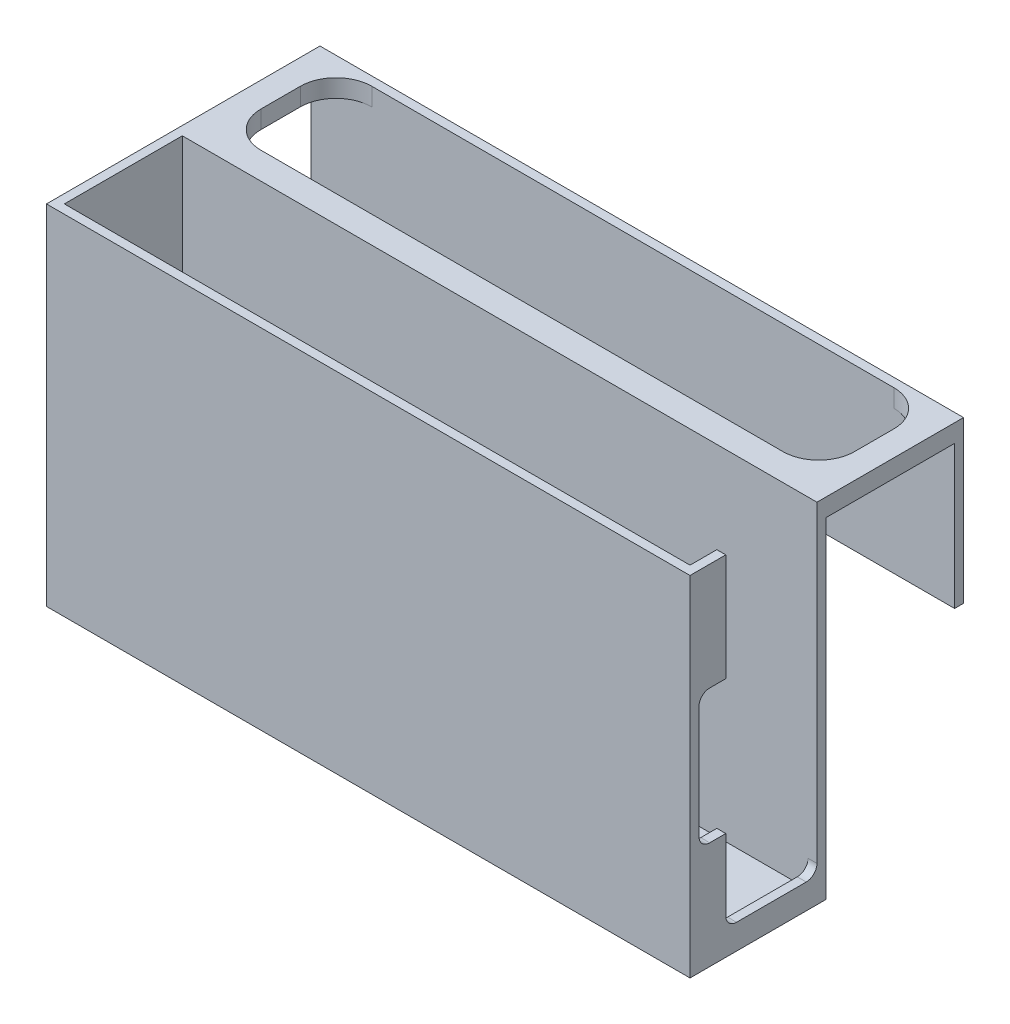
ISO-10303-21;
HEADER;
FILE_DESCRIPTION(('STEP AP214'),'2;1');
FILE_NAME('part.step','',(''),(''),'','','');
FILE_SCHEMA(('AUTOMOTIVE_DESIGN { 1 0 10303 214 1 1 1 1 }'));
ENDSEC;
DATA;
#1=APPLICATION_CONTEXT('core data for automotive mechanical design processes');
#2=APPLICATION_PROTOCOL_DEFINITION('international standard','automotive_design',2000,#1);
#3=PRODUCT_CONTEXT('',#1,'mechanical');
#4=PRODUCT('Part','Part','',(#3));
#5=PRODUCT_RELATED_PRODUCT_CATEGORY('part','',(#4));
#6=PRODUCT_DEFINITION_FORMATION('','',#4);
#7=PRODUCT_DEFINITION_CONTEXT('part definition',#1,'design');
#8=PRODUCT_DEFINITION('design','',#6,#7);
#9=PRODUCT_DEFINITION_SHAPE('','',#8);
#10=(LENGTH_UNIT() NAMED_UNIT(*) SI_UNIT(.MILLI.,.METRE.));
#11=(NAMED_UNIT(*) PLANE_ANGLE_UNIT() SI_UNIT($,.RADIAN.));
#12=(NAMED_UNIT(*) SI_UNIT($,.STERADIAN.) SOLID_ANGLE_UNIT());
#13=UNCERTAINTY_MEASURE_WITH_UNIT(LENGTH_MEASURE(1.E-05),#10,'distance_accuracy_value','');
#14=(GEOMETRIC_REPRESENTATION_CONTEXT(3) GLOBAL_UNCERTAINTY_ASSIGNED_CONTEXT((#13)) GLOBAL_UNIT_ASSIGNED_CONTEXT((#10,
#11,#12)) REPRESENTATION_CONTEXT('',''));
#15=CARTESIAN_POINT('',(0.,0.,0.));
#16=DIRECTION('',(0.,0.,1.));
#17=DIRECTION('',(1.,0.,0.));
#18=AXIS2_PLACEMENT_3D('',#15,#16,#17);
#19=CARTESIAN_POINT('',(-73.,43.75,-61.5));
#20=DIRECTION('',(0.,-1.,0.));
#21=DIRECTION('',(0.,0.,-1.));
#22=AXIS2_PLACEMENT_3D('',#19,#20,#21);
#23=CYLINDRICAL_SURFACE('',#22,10.);
#24=DIRECTION('',(0.,1.,0.));
#25=VECTOR('',#24,1.);
#26=CARTESIAN_POINT('',(-83.,43.75,-61.5));
#27=LINE('',#26,#25);
#28=CARTESIAN_POINT('',(-83.,43.75,-61.5));
#29=VERTEX_POINT('',#28);
#30=CARTESIAN_POINT('',(-83.,48.75,-61.5));
#31=VERTEX_POINT('',#30);
#32=EDGE_CURVE('E380',#29,#31,#27,.T.);
#33=ORIENTED_EDGE('',*,*,#32,.F.);
#34=CARTESIAN_POINT('',(-73.,43.75,-61.5));
#35=DIRECTION('',(0.,1.,0.));
#36=DIRECTION('',(-1.,0.,0.));
#37=AXIS2_PLACEMENT_3D('',#34,#35,#36);
#38=CIRCLE('',#37,10.);
#39=CARTESIAN_POINT('',(-73.,43.75,-71.5));
#40=VERTEX_POINT('',#39);
#41=EDGE_CURVE('E39',#29,#40,#38,.F.);
#42=ORIENTED_EDGE('',*,*,#41,.T.);
#43=DIRECTION('',(0.,1.,0.));
#44=VECTOR('',#43,1.);
#45=CARTESIAN_POINT('',(-73.,43.75,-71.5));
#46=LINE('',#45,#44);
#47=CARTESIAN_POINT('',(-73.,48.75,-71.5));
#48=VERTEX_POINT('',#47);
#49=EDGE_CURVE('E383',#48,#40,#46,.F.);
#50=ORIENTED_EDGE('',*,*,#49,.F.);
#51=CARTESIAN_POINT('',(-73.,48.75,-61.5));
#52=DIRECTION('',(0.,-1.,0.));
#53=DIRECTION('',(0.,0.,-1.));
#54=AXIS2_PLACEMENT_3D('',#51,#52,#53);
#55=CIRCLE('',#54,10.);
#56=EDGE_CURVE('E11',#48,#31,#55,.F.);
#57=ORIENTED_EDGE('',*,*,#56,.T.);
#58=EDGE_LOOP('',(#33,#42,#50,#57));
#59=FACE_BOUND('',#58,.T.);
#60=ADVANCED_FACE('F32',(#59),#23,.F.);
#61=CARTESIAN_POINT('',(-73.,43.75,-50.5));
#62=DIRECTION('',(0.,-1.,0.));
#63=DIRECTION('',(0.,0.,-1.));
#64=AXIS2_PLACEMENT_3D('',#61,#62,#63);
#65=CYLINDRICAL_SURFACE('',#64,10.);
#66=DIRECTION('',(0.,1.,0.));
#67=VECTOR('',#66,1.);
#68=CARTESIAN_POINT('',(-73.,43.75,-40.5));
#69=LINE('',#68,#67);
#70=CARTESIAN_POINT('',(-73.,43.75,-40.5));
#71=VERTEX_POINT('',#70);
#72=CARTESIAN_POINT('',(-73.,48.75,-40.5));
#73=VERTEX_POINT('',#72);
#74=EDGE_CURVE('E369',#71,#73,#69,.T.);
#75=ORIENTED_EDGE('',*,*,#74,.F.);
#76=CARTESIAN_POINT('',(-73.,43.75,-50.5));
#77=DIRECTION('',(0.,1.,0.));
#78=DIRECTION('',(-1.,0.,0.));
#79=AXIS2_PLACEMENT_3D('',#76,#77,#78);
#80=CIRCLE('',#79,10.);
#81=CARTESIAN_POINT('',(-83.,43.75,-50.5));
#82=VERTEX_POINT('',#81);
#83=EDGE_CURVE('E375',#71,#82,#80,.F.);
#84=ORIENTED_EDGE('',*,*,#83,.T.);
#85=DIRECTION('',(0.,1.,0.));
#86=VECTOR('',#85,1.);
#87=CARTESIAN_POINT('',(-83.,43.75,-50.5));
#88=LINE('',#87,#86);
#89=CARTESIAN_POINT('',(-83.,48.75,-50.5));
#90=VERTEX_POINT('',#89);
#91=EDGE_CURVE('E372',#90,#82,#88,.F.);
#92=ORIENTED_EDGE('',*,*,#91,.F.);
#93=CARTESIAN_POINT('',(-73.,48.75,-50.5));
#94=DIRECTION('',(0.,-1.,0.));
#95=DIRECTION('',(0.,0.,-1.));
#96=AXIS2_PLACEMENT_3D('',#93,#94,#95);
#97=CIRCLE('',#96,10.);
#98=EDGE_CURVE('E378',#90,#73,#97,.F.);
#99=ORIENTED_EDGE('',*,*,#98,.T.);
#100=EDGE_LOOP('',(#75,#84,#92,#99));
#101=FACE_BOUND('',#100,.T.);
#102=ADVANCED_FACE('F560',(#101),#65,.F.);
#103=CARTESIAN_POINT('',(73.,43.75,-61.5));
#104=DIRECTION('',(0.,1.,0.));
#105=DIRECTION('',(0.,0.,1.));
#106=AXIS2_PLACEMENT_3D('',#103,#104,#105);
#107=CYLINDRICAL_SURFACE('',#106,10.);
#108=DIRECTION('',(0.,-1.,0.));
#109=VECTOR('',#108,1.);
#110=CARTESIAN_POINT('',(83.,43.75,-61.5));
#111=LINE('',#110,#109);
#112=CARTESIAN_POINT('',(83.,48.75,-61.5));
#113=VERTEX_POINT('',#112);
#114=CARTESIAN_POINT('',(83.,43.75,-61.5));
#115=VERTEX_POINT('',#114);
#116=EDGE_CURVE('E359',#113,#115,#111,.T.);
#117=ORIENTED_EDGE('',*,*,#116,.F.);
#118=CARTESIAN_POINT('',(73.,48.75,-61.5));
#119=DIRECTION('',(0.,-1.,0.));
#120=DIRECTION('',(0.,0.,-1.));
#121=AXIS2_PLACEMENT_3D('',#118,#119,#120);
#122=CIRCLE('',#121,10.);
#123=CARTESIAN_POINT('',(72.9999999999999,48.75,-71.5));
#124=VERTEX_POINT('',#123);
#125=EDGE_CURVE('E365',#113,#124,#122,.F.);
#126=ORIENTED_EDGE('',*,*,#125,.T.);
#127=DIRECTION('',(0.,-1.,0.));
#128=VECTOR('',#127,1.);
#129=CARTESIAN_POINT('',(73.,43.75,-71.5));
#130=LINE('',#129,#128);
#131=CARTESIAN_POINT('',(73.,43.75,-71.5));
#132=VERTEX_POINT('',#131);
#133=EDGE_CURVE('E362',#132,#124,#130,.F.);
#134=ORIENTED_EDGE('',*,*,#133,.F.);
#135=CARTESIAN_POINT('',(73.,43.75,-61.5));
#136=DIRECTION('',(0.,1.,0.));
#137=DIRECTION('',(-1.,0.,0.));
#138=AXIS2_PLACEMENT_3D('',#135,#136,#137);
#139=CIRCLE('',#138,10.);
#140=EDGE_CURVE('E367',#132,#115,#139,.F.);
#141=ORIENTED_EDGE('',*,*,#140,.T.);
#142=EDGE_LOOP('',(#117,#126,#134,#141));
#143=FACE_BOUND('',#142,.T.);
#144=ADVANCED_FACE('F564',(#143),#107,.F.);
#145=CARTESIAN_POINT('',(73.,43.75,-50.5));
#146=DIRECTION('',(0.,-1.,0.));
#147=DIRECTION('',(0.,0.,-1.));
#148=AXIS2_PLACEMENT_3D('',#145,#146,#147);
#149=CYLINDRICAL_SURFACE('',#148,10.);
#150=DIRECTION('',(0.,1.,0.));
#151=VECTOR('',#150,1.);
#152=CARTESIAN_POINT('',(83.,43.75,-50.5));
#153=LINE('',#152,#151);
#154=CARTESIAN_POINT('',(83.,43.75,-50.5));
#155=VERTEX_POINT('',#154);
#156=CARTESIAN_POINT('',(83.,48.75,-50.5));
#157=VERTEX_POINT('',#156);
#158=EDGE_CURVE('E348',#155,#157,#153,.T.);
#159=ORIENTED_EDGE('',*,*,#158,.F.);
#160=CARTESIAN_POINT('',(73.,43.75,-50.5));
#161=DIRECTION('',(0.,1.,0.));
#162=DIRECTION('',(-1.,0.,0.));
#163=AXIS2_PLACEMENT_3D('',#160,#161,#162);
#164=CIRCLE('',#163,10.);
#165=CARTESIAN_POINT('',(72.9999999999999,43.75,-40.5));
#166=VERTEX_POINT('',#165);
#167=EDGE_CURVE('E354',#155,#166,#164,.F.);
#168=ORIENTED_EDGE('',*,*,#167,.T.);
#169=DIRECTION('',(0.,1.,0.));
#170=VECTOR('',#169,1.);
#171=CARTESIAN_POINT('',(73.,43.75,-40.5));
#172=LINE('',#171,#170);
#173=CARTESIAN_POINT('',(72.9999999999999,48.75,-40.5));
#174=VERTEX_POINT('',#173);
#175=EDGE_CURVE('E351',#174,#166,#172,.F.);
#176=ORIENTED_EDGE('',*,*,#175,.F.);
#177=CARTESIAN_POINT('',(73.,48.75,-50.5));
#178=DIRECTION('',(0.,-1.,0.));
#179=DIRECTION('',(0.,0.,-1.));
#180=AXIS2_PLACEMENT_3D('',#177,#178,#179);
#181=CIRCLE('',#180,10.);
#182=EDGE_CURVE('E357',#174,#157,#181,.F.);
#183=ORIENTED_EDGE('',*,*,#182,.T.);
#184=EDGE_LOOP('',(#159,#168,#176,#183));
#185=FACE_BOUND('',#184,.T.);
#186=ADVANCED_FACE('F569',(#185),#149,.F.);
#187=CARTESIAN_POINT('',(87.5,46.25,-33.));
#188=DIRECTION('',(-1.,0.,0.));
#189=DIRECTION('',(0.,-1.,0.));
#190=AXIS2_PLACEMENT_3D('',#187,#188,#189);
#191=PLANE('',#190);
#192=CARTESIAN_POINT('',(87.5,-38.75,-30.));
#193=DIRECTION('',(1.,0.,0.));
#194=DIRECTION('',(0.,-1.,0.));
#195=AXIS2_PLACEMENT_3D('',#192,#193,#194);
#196=CIRCLE('',#195,3.);
#197=CARTESIAN_POINT('',(87.5,-41.75,-30.));
#198=VERTEX_POINT('',#197);
#199=CARTESIAN_POINT('',(87.5,-38.75,-33.));
#200=VERTEX_POINT('',#199);
#201=EDGE_CURVE('E255',#198,#200,#196,.T.);
#202=ORIENTED_EDGE('',*,*,#201,.T.);
#203=DIRECTION('',(0.,-1.,0.));
#204=VECTOR('',#203,1.);
#205=CARTESIAN_POINT('',(87.5,46.25,-33.));
#206=LINE('',#205,#204);
#207=CARTESIAN_POINT('',(87.5,-46.25,-33.));
#208=VERTEX_POINT('',#207);
#209=EDGE_CURVE('E312',#200,#208,#206,.T.);
#210=ORIENTED_EDGE('',*,*,#209,.T.);
#211=DIRECTION('',(0.,0.,1.));
#212=VECTOR('',#211,1.);
#213=CARTESIAN_POINT('',(87.5,-46.25,-33.));
#214=LINE('',#213,#212);
#215=CARTESIAN_POINT('',(87.5,-46.25,0.));
#216=VERTEX_POINT('',#215);
#217=EDGE_CURVE('E327',#208,#216,#214,.T.);
#218=ORIENTED_EDGE('',*,*,#217,.T.);
#219=DIRECTION('',(0.,-1.,0.));
#220=VECTOR('',#219,1.);
#221=CARTESIAN_POINT('',(87.5,46.25,0.));
#222=LINE('',#221,#220);
#223=CARTESIAN_POINT('',(87.5,-15.75,0.));
#224=VERTEX_POINT('',#223);
#225=EDGE_CURVE('E311',#224,#216,#222,.T.);
#226=ORIENTED_EDGE('',*,*,#225,.F.);
#227=CARTESIAN_POINT('',(87.5,-15.75,-3.));
#228=DIRECTION('',(1.,0.,0.));
#229=DIRECTION('',(0.,1.,0.));
#230=AXIS2_PLACEMENT_3D('',#227,#228,#229);
#231=CIRCLE('',#230,3.);
#232=CARTESIAN_POINT('',(87.5,-18.75,-3.00000000000002));
#233=VERTEX_POINT('',#232);
#234=EDGE_CURVE('E407',#224,#233,#231,.T.);
#235=ORIENTED_EDGE('',*,*,#234,.T.);
#236=DIRECTION('',(0.,0.,-1.));
#237=VECTOR('',#236,1.);
#238=CARTESIAN_POINT('',(87.5,-18.75,-3.00000000000003));
#239=LINE('',#238,#237);
#240=CARTESIAN_POINT('',(87.5,-18.75,-7.50000000000001));
#241=VERTEX_POINT('',#240);
#242=EDGE_CURVE('E410',#233,#241,#239,.T.);
#243=ORIENTED_EDGE('',*,*,#242,.T.);
#244=DIRECTION('',(0.,-1.,0.));
#245=VECTOR('',#244,1.);
#246=CARTESIAN_POINT('',(87.5,-18.75,-7.50000000000001));
#247=LINE('',#246,#245);
#248=CARTESIAN_POINT('',(87.5,-38.75,-7.50000000000001));
#249=VERTEX_POINT('',#248);
#250=EDGE_CURVE('E413',#241,#249,#247,.T.);
#251=ORIENTED_EDGE('',*,*,#250,.T.);
#252=CARTESIAN_POINT('',(87.5,-38.75,-10.5));
#253=DIRECTION('',(1.,0.,0.));
#254=DIRECTION('',(0.,-1.,0.));
#255=AXIS2_PLACEMENT_3D('',#252,#253,#254);
#256=CIRCLE('',#255,3.);
#257=CARTESIAN_POINT('',(87.5,-41.75,-10.5));
#258=VERTEX_POINT('',#257);
#259=EDGE_CURVE('E416',#249,#258,#256,.T.);
#260=ORIENTED_EDGE('',*,*,#259,.T.);
#261=DIRECTION('',(0.,0.,-1.));
#262=VECTOR('',#261,1.);
#263=CARTESIAN_POINT('',(87.5,-41.75,-30.));
#264=LINE('',#263,#262);
#265=EDGE_CURVE('E419',#258,#198,#264,.T.);
#266=ORIENTED_EDGE('',*,*,#265,.T.);
#267=EDGE_LOOP('',(#202,#210,#218,#226,#235,#243,#251,#260,#266));
#268=FACE_BOUND('',#267,.T.);
#269=ADVANCED_FACE('F488',(#268),#191,.T.);
#270=CARTESIAN_POINT('',(90.,43.75,-74.));
#271=DIRECTION('',(0.,1.,0.));
#272=DIRECTION('',(-1.,0.,0.));
#273=AXIS2_PLACEMENT_3D('',#270,#271,#272);
#274=PLANE('',#273);
#275=ORIENTED_EDGE('',*,*,#83,.F.);
#276=DIRECTION('',(1.,0.,0.));
#277=VECTOR('',#276,1.);
#278=CARTESIAN_POINT('',(-83.,43.75,-40.5));
#279=LINE('',#278,#277);
#280=EDGE_CURVE('E397',#71,#166,#279,.T.);
#281=ORIENTED_EDGE('',*,*,#280,.T.);
#282=ORIENTED_EDGE('',*,*,#167,.F.);
#283=DIRECTION('',(0.,0.,-1.));
#284=VECTOR('',#283,1.);
#285=CARTESIAN_POINT('',(83.,43.75,-71.5));
#286=LINE('',#285,#284);
#287=EDGE_CURVE('E428',#155,#115,#286,.T.);
#288=ORIENTED_EDGE('',*,*,#287,.T.);
#289=ORIENTED_EDGE('',*,*,#140,.F.);
#290=DIRECTION('',(-1.,0.,0.));
#291=VECTOR('',#290,1.);
#292=CARTESIAN_POINT('',(-90.,43.75,-71.5));
#293=LINE('',#292,#291);
#294=CARTESIAN_POINT('',(90.,43.75,-71.5));
#295=VERTEX_POINT('',#294);
#296=EDGE_CURVE('E275',#295,#132,#293,.T.);
#297=ORIENTED_EDGE('',*,*,#296,.F.);
#298=DIRECTION('',(0.,0.,1.));
#299=VECTOR('',#298,1.);
#300=CARTESIAN_POINT('',(90.,43.75,-74.));
#301=LINE('',#300,#299);
#302=CARTESIAN_POINT('',(90.,43.75,-35.5));
#303=VERTEX_POINT('',#302);
#304=EDGE_CURVE('E301',#295,#303,#301,.T.);
#305=ORIENTED_EDGE('',*,*,#304,.T.);
#306=DIRECTION('',(-1.,0.,0.));
#307=VECTOR('',#306,1.);
#308=CARTESIAN_POINT('',(90.,43.75,-35.5));
#309=LINE('',#308,#307);
#310=CARTESIAN_POINT('',(-90.,43.75,-35.5));
#311=VERTEX_POINT('',#310);
#312=EDGE_CURVE('E288',#303,#311,#309,.T.);
#313=ORIENTED_EDGE('',*,*,#312,.T.);
#314=DIRECTION('',(0.,0.,1.));
#315=VECTOR('',#314,1.);
#316=CARTESIAN_POINT('',(-90.,43.75,-74.));
#317=LINE('',#316,#315);
#318=CARTESIAN_POINT('',(-90.,43.75,-71.5));
#319=VERTEX_POINT('',#318);
#320=EDGE_CURVE('E297',#319,#311,#317,.T.);
#321=ORIENTED_EDGE('',*,*,#320,.F.);
#322=EDGE_CURVE('E46',#40,#319,#293,.T.);
#323=ORIENTED_EDGE('',*,*,#322,.F.);
#324=ORIENTED_EDGE('',*,*,#41,.F.);
#325=DIRECTION('',(0.,0.,1.));
#326=VECTOR('',#325,1.);
#327=CARTESIAN_POINT('',(-83.,43.75,-71.5));
#328=LINE('',#327,#326);
#329=EDGE_CURVE('E394',#29,#82,#328,.T.);
#330=ORIENTED_EDGE('',*,*,#329,.T.);
#331=EDGE_LOOP('',(#275,#281,#282,#288,#289,#297,#305,#313,#321,#323,#324,#330));
#332=FACE_BOUND('',#331,.T.);
#333=ADVANCED_FACE('F580',(#332),#274,.F.);
#334=CARTESIAN_POINT('',(-90.,48.75,2.5));
#335=DIRECTION('',(1.,0.,0.));
#336=DIRECTION('',(0.,1.,0.));
#337=AXIS2_PLACEMENT_3D('',#334,#335,#336);
#338=PLANE('',#337);
#339=DIRECTION('',(0.,0.,-1.));
#340=VECTOR('',#339,1.);
#341=CARTESIAN_POINT('',(-90.,48.75,2.5));
#342=LINE('',#341,#340);
#343=CARTESIAN_POINT('',(-90.,48.75,2.5));
#344=VERTEX_POINT('',#343);
#345=CARTESIAN_POINT('',(-90.,48.75,-74.));
#346=VERTEX_POINT('',#345);
#347=EDGE_CURVE('E339',#344,#346,#342,.T.);
#348=ORIENTED_EDGE('',*,*,#347,.T.);
#349=DIRECTION('',(0.,1.,0.));
#350=VECTOR('',#349,1.);
#351=CARTESIAN_POINT('',(-90.,48.75,-74.));
#352=LINE('',#351,#350);
#353=CARTESIAN_POINT('',(-90.,3.75000000000001,-74.));
#354=VERTEX_POINT('',#353);
#355=EDGE_CURVE('E291',#354,#346,#352,.T.);
#356=ORIENTED_EDGE('',*,*,#355,.F.);
#357=DIRECTION('',(0.,0.,-1.));
#358=VECTOR('',#357,1.);
#359=CARTESIAN_POINT('',(-90.,3.75000000000001,-74.));
#360=LINE('',#359,#358);
#361=CARTESIAN_POINT('',(-90.,3.75000000000001,-71.5));
#362=VERTEX_POINT('',#361);
#363=EDGE_CURVE('E271',#362,#354,#360,.T.);
#364=ORIENTED_EDGE('',*,*,#363,.F.);
#365=DIRECTION('',(0.,1.,0.));
#366=VECTOR('',#365,1.);
#367=CARTESIAN_POINT('',(-90.,3.75000000000001,-71.5));
#368=LINE('',#367,#366);
#369=EDGE_CURVE('E282',#362,#319,#368,.T.);
#370=ORIENTED_EDGE('',*,*,#369,.T.);
#371=ORIENTED_EDGE('',*,*,#320,.T.);
#372=DIRECTION('',(0.,1.,0.));
#373=VECTOR('',#372,1.);
#374=CARTESIAN_POINT('',(-90.,48.75,-35.5));
#375=LINE('',#374,#373);
#376=CARTESIAN_POINT('',(-90.,-48.75,-35.5));
#377=VERTEX_POINT('',#376);
#378=EDGE_CURVE('E308',#377,#311,#375,.T.);
#379=ORIENTED_EDGE('',*,*,#378,.F.);
#380=DIRECTION('',(0.,0.,-1.));
#381=VECTOR('',#380,1.);
#382=CARTESIAN_POINT('',(-90.,-48.75,2.5));
#383=LINE('',#382,#381);
#384=CARTESIAN_POINT('',(-90.,-48.75,2.5));
#385=VERTEX_POINT('',#384);
#386=EDGE_CURVE('E346',#385,#377,#383,.T.);
#387=ORIENTED_EDGE('',*,*,#386,.F.);
#388=DIRECTION('',(0.,-1.,0.));
#389=VECTOR('',#388,1.);
#390=CARTESIAN_POINT('',(-90.,48.75,2.5));
#391=LINE('',#390,#389);
#392=EDGE_CURVE('E330',#344,#385,#391,.T.);
#393=ORIENTED_EDGE('',*,*,#392,.F.);
#394=EDGE_LOOP('',(#348,#356,#364,#370,#371,#379,#387,#393));
#395=FACE_BOUND('',#394,.T.);
#396=ADVANCED_FACE('F512',(#395),#338,.F.);
#397=CARTESIAN_POINT('',(-90.,-48.75,2.5));
#398=DIRECTION('',(0.,1.,0.));
#399=DIRECTION('',(0.,0.,1.));
#400=AXIS2_PLACEMENT_3D('',#397,#398,#399);
#401=PLANE('',#400);
#402=ORIENTED_EDGE('',*,*,#386,.T.);
#403=DIRECTION('',(-1.,0.,0.));
#404=VECTOR('',#403,1.);
#405=CARTESIAN_POINT('',(90.,-48.75,-35.5));
#406=LINE('',#405,#404);
#407=CARTESIAN_POINT('',(90.,-48.75,-35.5));
#408=VERTEX_POINT('',#407);
#409=EDGE_CURVE('E305',#408,#377,#406,.T.);
#410=ORIENTED_EDGE('',*,*,#409,.F.);
#411=DIRECTION('',(0.,0.,-1.));
#412=VECTOR('',#411,1.);
#413=CARTESIAN_POINT('',(90.,-48.75,2.5));
#414=LINE('',#413,#412);
#415=CARTESIAN_POINT('',(90.,-48.75,2.5));
#416=VERTEX_POINT('',#415);
#417=EDGE_CURVE('E343',#416,#408,#414,.T.);
#418=ORIENTED_EDGE('',*,*,#417,.F.);
#419=DIRECTION('',(1.,0.,0.));
#420=VECTOR('',#419,1.);
#421=CARTESIAN_POINT('',(-90.,-48.75,2.5));
#422=LINE('',#421,#420);
#423=EDGE_CURVE('E333',#385,#416,#422,.T.);
#424=ORIENTED_EDGE('',*,*,#423,.F.);
#425=EDGE_LOOP('',(#402,#410,#418,#424));
#426=FACE_BOUND('',#425,.T.);
#427=ADVANCED_FACE('F579',(#426),#401,.F.);
#428=CARTESIAN_POINT('',(90.,48.75,2.5));
#429=DIRECTION('',(-1.,0.,0.));
#430=DIRECTION('',(0.,-1.,0.));
#431=AXIS2_PLACEMENT_3D('',#428,#429,#430);
#432=PLANE('',#431);
#433=DIRECTION('',(0.,0.,-1.));
#434=VECTOR('',#433,1.);
#435=CARTESIAN_POINT('',(90.,48.75,2.5));
#436=LINE('',#435,#434);
#437=CARTESIAN_POINT('',(90.,48.75,-33.));
#438=VERTEX_POINT('',#437);
#439=CARTESIAN_POINT('',(90.,48.75,-74.));
#440=VERTEX_POINT('',#439);
#441=EDGE_CURVE('E341',#438,#440,#436,.T.);
#442=ORIENTED_EDGE('',*,*,#441,.F.);
#443=DIRECTION('',(0.,1.,0.));
#444=VECTOR('',#443,1.);
#445=CARTESIAN_POINT('',(90.,48.75,-33.));
#446=LINE('',#445,#444);
#447=CARTESIAN_POINT('',(90.,-38.75,-33.));
#448=VERTEX_POINT('',#447);
#449=EDGE_CURVE('E424',#448,#438,#446,.T.);
#450=ORIENTED_EDGE('',*,*,#449,.F.);
#451=CARTESIAN_POINT('',(90.,-38.75,-30.));
#452=DIRECTION('',(1.,0.,0.));
#453=DIRECTION('',(0.,-1.,0.));
#454=AXIS2_PLACEMENT_3D('',#451,#452,#453);
#455=CIRCLE('',#454,3.);
#456=CARTESIAN_POINT('',(90.,-41.75,-30.));
#457=VERTEX_POINT('',#456);
#458=EDGE_CURVE('E244',#457,#448,#455,.T.);
#459=ORIENTED_EDGE('',*,*,#458,.F.);
#460=DIRECTION('',(0.,0.,-1.));
#461=VECTOR('',#460,1.);
#462=CARTESIAN_POINT('',(90.,-41.75,-30.));
#463=LINE('',#462,#461);
#464=CARTESIAN_POINT('',(90.,-41.75,-10.5));
#465=VERTEX_POINT('',#464);
#466=EDGE_CURVE('E451',#465,#457,#463,.T.);
#467=ORIENTED_EDGE('',*,*,#466,.F.);
#468=CARTESIAN_POINT('',(90.,-38.75,-10.5));
#469=DIRECTION('',(1.,0.,0.));
#470=DIRECTION('',(0.,-1.,0.));
#471=AXIS2_PLACEMENT_3D('',#468,#469,#470);
#472=CIRCLE('',#471,3.);
#473=CARTESIAN_POINT('',(90.,-38.75,-7.50000000000001));
#474=VERTEX_POINT('',#473);
#475=EDGE_CURVE('E448',#474,#465,#472,.T.);
#476=ORIENTED_EDGE('',*,*,#475,.F.);
#477=DIRECTION('',(0.,-1.,0.));
#478=VECTOR('',#477,1.);
#479=CARTESIAN_POINT('',(90.,-18.75,-7.50000000000001));
#480=LINE('',#479,#478);
#481=CARTESIAN_POINT('',(90.,-18.75,-7.50000000000001));
#482=VERTEX_POINT('',#481);
#483=EDGE_CURVE('E445',#482,#474,#480,.T.);
#484=ORIENTED_EDGE('',*,*,#483,.F.);
#485=DIRECTION('',(0.,0.,-1.));
#486=VECTOR('',#485,1.);
#487=CARTESIAN_POINT('',(90.,-18.75,-3.00000000000003));
#488=LINE('',#487,#486);
#489=CARTESIAN_POINT('',(90.,-18.75,-3.00000000000002));
#490=VERTEX_POINT('',#489);
#491=EDGE_CURVE('E442',#490,#482,#488,.T.);
#492=ORIENTED_EDGE('',*,*,#491,.F.);
#493=CARTESIAN_POINT('',(90.,-15.75,-3.));
#494=DIRECTION('',(1.,0.,0.));
#495=DIRECTION('',(0.,1.,0.));
#496=AXIS2_PLACEMENT_3D('',#493,#494,#495);
#497=CIRCLE('',#496,3.);
#498=CARTESIAN_POINT('',(90.,-15.75,0.));
#499=VERTEX_POINT('',#498);
#500=EDGE_CURVE('E439',#499,#490,#497,.T.);
#501=ORIENTED_EDGE('',*,*,#500,.F.);
#502=DIRECTION('',(0.,-1.,0.));
#503=VECTOR('',#502,1.);
#504=CARTESIAN_POINT('',(90.,15.75,0.));
#505=LINE('',#504,#503);
#506=CARTESIAN_POINT('',(90.,15.75,0.));
#507=VERTEX_POINT('',#506);
#508=EDGE_CURVE('E436',#507,#499,#505,.T.);
#509=ORIENTED_EDGE('',*,*,#508,.F.);
#510=CARTESIAN_POINT('',(90.,15.75,-3.));
#511=DIRECTION('',(1.,0.,0.));
#512=DIRECTION('',(0.,1.,0.));
#513=AXIS2_PLACEMENT_3D('',#510,#511,#512);
#514=CIRCLE('',#513,3.);
#515=CARTESIAN_POINT('',(90.,18.75,-3.00000000000002));
#516=VERTEX_POINT('',#515);
#517=EDGE_CURVE('E433',#516,#507,#514,.T.);
#518=ORIENTED_EDGE('',*,*,#517,.F.);
#519=DIRECTION('',(0.,0.,1.));
#520=VECTOR('',#519,1.);
#521=CARTESIAN_POINT('',(90.,18.75,-3.00000000000002));
#522=LINE('',#521,#520);
#523=CARTESIAN_POINT('',(90.,18.75,-7.5));
#524=VERTEX_POINT('',#523);
#525=EDGE_CURVE('E430',#524,#516,#522,.T.);
#526=ORIENTED_EDGE('',*,*,#525,.F.);
#527=DIRECTION('',(0.,-1.,0.));
#528=VECTOR('',#527,1.);
#529=CARTESIAN_POINT('',(90.,48.75,-7.5));
#530=LINE('',#529,#528);
#531=CARTESIAN_POINT('',(90.,48.75,-7.5));
#532=VERTEX_POINT('',#531);
#533=EDGE_CURVE('E427',#532,#524,#530,.T.);
#534=ORIENTED_EDGE('',*,*,#533,.F.);
#535=CARTESIAN_POINT('',(90.,48.75,2.5));
#536=VERTEX_POINT('',#535);
#537=EDGE_CURVE('E254',#536,#532,#436,.T.);
#538=ORIENTED_EDGE('',*,*,#537,.F.);
#539=DIRECTION('',(0.,1.,0.));
#540=VECTOR('',#539,1.);
#541=CARTESIAN_POINT('',(90.,48.75,2.5));
#542=LINE('',#541,#540);
#543=EDGE_CURVE('E335',#416,#536,#542,.T.);
#544=ORIENTED_EDGE('',*,*,#543,.F.);
#545=ORIENTED_EDGE('',*,*,#417,.T.);
#546=DIRECTION('',(0.,-1.,0.));
#547=VECTOR('',#546,1.);
#548=CARTESIAN_POINT('',(90.,48.75,-35.5));
#549=LINE('',#548,#547);
#550=EDGE_CURVE('E303',#303,#408,#549,.T.);
#551=ORIENTED_EDGE('',*,*,#550,.F.);
#552=ORIENTED_EDGE('',*,*,#304,.F.);
#553=DIRECTION('',(0.,1.,0.));
#554=VECTOR('',#553,1.);
#555=CARTESIAN_POINT('',(90.,3.75000000000001,-71.5));
#556=LINE('',#555,#554);
#557=CARTESIAN_POINT('',(90.,3.75000000000001,-71.5));
#558=VERTEX_POINT('',#557);
#559=EDGE_CURVE('E286',#558,#295,#556,.T.);
#560=ORIENTED_EDGE('',*,*,#559,.F.);
#561=DIRECTION('',(0.,0.,1.));
#562=VECTOR('',#561,1.);
#563=CARTESIAN_POINT('',(90.,3.75000000000001,-74.));
#564=LINE('',#563,#562);
#565=CARTESIAN_POINT('',(90.,3.75000000000001,-74.));
#566=VERTEX_POINT('',#565);
#567=EDGE_CURVE('E278',#566,#558,#564,.T.);
#568=ORIENTED_EDGE('',*,*,#567,.F.);
#569=DIRECTION('',(0.,-1.,0.));
#570=VECTOR('',#569,1.);
#571=CARTESIAN_POINT('',(90.,48.75,-74.));
#572=LINE('',#571,#570);
#573=EDGE_CURVE('E289',#440,#566,#572,.T.);
#574=ORIENTED_EDGE('',*,*,#573,.F.);
#575=EDGE_LOOP('',(#442,#450,#459,#467,#476,#484,#492,#501,#509,#518,#526,#534,#538,#544,#545,
#551,#552,#560,#568,#574));
#576=FACE_BOUND('',#575,.T.);
#577=ADVANCED_FACE('F504',(#576),#432,.F.);
#578=CARTESIAN_POINT('',(-90.,48.75,2.5));
#579=DIRECTION('',(0.,-1.,0.));
#580=DIRECTION('',(0.,0.,-1.));
#581=AXIS2_PLACEMENT_3D('',#578,#579,#580);
#582=PLANE('',#581);
#583=DIRECTION('',(1.,0.,0.));
#584=VECTOR('',#583,1.);
#585=CARTESIAN_POINT('',(-83.,48.75,-40.5));
#586=LINE('',#585,#584);
#587=EDGE_CURVE('E400',#73,#174,#586,.T.);
#588=ORIENTED_EDGE('',*,*,#587,.F.);
#589=ORIENTED_EDGE('',*,*,#98,.F.);
#590=DIRECTION('',(0.,0.,1.));
#591=VECTOR('',#590,1.);
#592=CARTESIAN_POINT('',(-83.,48.75,-71.5));
#593=LINE('',#592,#591);
#594=EDGE_CURVE('E894',#31,#90,#593,.T.);
#595=ORIENTED_EDGE('',*,*,#594,.F.);
#596=ORIENTED_EDGE('',*,*,#56,.F.);
#597=DIRECTION('',(-1.,0.,0.));
#598=VECTOR('',#597,1.);
#599=CARTESIAN_POINT('',(-83.,48.75,-71.5));
#600=LINE('',#599,#598);
#601=EDGE_CURVE('E392',#124,#48,#600,.T.);
#602=ORIENTED_EDGE('',*,*,#601,.F.);
#603=ORIENTED_EDGE('',*,*,#125,.F.);
#604=DIRECTION('',(0.,0.,-1.));
#605=VECTOR('',#604,1.);
#606=CARTESIAN_POINT('',(83.,48.75,-71.5));
#607=LINE('',#606,#605);
#608=EDGE_CURVE('E395',#157,#113,#607,.T.);
#609=ORIENTED_EDGE('',*,*,#608,.F.);
#610=ORIENTED_EDGE('',*,*,#182,.F.);
#611=EDGE_LOOP('',(#588,#589,#595,#596,#602,#603,#609,#610));
#612=FACE_BOUND('',#611,.T.);
#613=DIRECTION('',(-1.,0.,0.));
#614=VECTOR('',#613,1.);
#615=CARTESIAN_POINT('',(-87.5,48.75,-33.));
#616=LINE('',#615,#614);
#617=CARTESIAN_POINT('',(-87.5,48.75,-33.));
#618=VERTEX_POINT('',#617);
#619=EDGE_CURVE('E262',#438,#618,#616,.T.);
#620=ORIENTED_EDGE('',*,*,#619,.F.);
#621=ORIENTED_EDGE('',*,*,#441,.T.);
#622=DIRECTION('',(1.,0.,0.));
#623=VECTOR('',#622,1.);
#624=CARTESIAN_POINT('',(90.,48.75,-74.));
#625=LINE('',#624,#623);
#626=EDGE_CURVE('E294',#346,#440,#625,.T.);
#627=ORIENTED_EDGE('',*,*,#626,.F.);
#628=ORIENTED_EDGE('',*,*,#347,.F.);
#629=DIRECTION('',(-1.,0.,0.));
#630=VECTOR('',#629,1.);
#631=CARTESIAN_POINT('',(-90.,48.75,2.5));
#632=LINE('',#631,#630);
#633=EDGE_CURVE('E337',#536,#344,#632,.T.);
#634=ORIENTED_EDGE('',*,*,#633,.F.);
#635=ORIENTED_EDGE('',*,*,#537,.T.);
#636=DIRECTION('',(1.,0.,0.));
#637=VECTOR('',#636,1.);
#638=CARTESIAN_POINT('',(87.5,48.75,-7.5));
#639=LINE('',#638,#637);
#640=CARTESIAN_POINT('',(87.5,48.75,-7.5));
#641=VERTEX_POINT('',#640);
#642=EDGE_CURVE('E236',#641,#532,#639,.T.);
#643=ORIENTED_EDGE('',*,*,#642,.F.);
#644=DIRECTION('',(0.,0.,-1.));
#645=VECTOR('',#644,1.);
#646=CARTESIAN_POINT('',(87.5,48.75,0.));
#647=LINE('',#646,#645);
#648=CARTESIAN_POINT('',(87.5,48.75,0.));
#649=VERTEX_POINT('',#648);
#650=EDGE_CURVE('E251',#649,#641,#647,.T.);
#651=ORIENTED_EDGE('',*,*,#650,.F.);
#652=DIRECTION('',(1.,0.,0.));
#653=VECTOR('',#652,1.);
#654=CARTESIAN_POINT('',(-87.5,48.75,0.));
#655=LINE('',#654,#653);
#656=CARTESIAN_POINT('',(-87.5,48.75,0.));
#657=VERTEX_POINT('',#656);
#658=EDGE_CURVE('E263',#657,#649,#655,.T.);
#659=ORIENTED_EDGE('',*,*,#658,.F.);
#660=DIRECTION('',(0.,0.,1.));
#661=VECTOR('',#660,1.);
#662=CARTESIAN_POINT('',(-87.5,48.75,0.));
#663=LINE('',#662,#661);
#664=EDGE_CURVE('E267',#618,#657,#663,.T.);
#665=ORIENTED_EDGE('',*,*,#664,.F.);
#666=EDGE_LOOP('',(#620,#621,#627,#628,#634,#635,#643,#651,#659,#665));
#667=FACE_BOUND('',#666,.T.);
#668=ADVANCED_FACE('F249',(#612,#667),#582,.F.);
#669=CARTESIAN_POINT('',(0.,0.,2.5));
#670=DIRECTION('',(0.,0.,1.));
#671=DIRECTION('',(1.,0.,0.));
#672=AXIS2_PLACEMENT_3D('',#669,#670,#671);
#673=PLANE('',#672);
#674=ORIENTED_EDGE('',*,*,#392,.T.);
#675=ORIENTED_EDGE('',*,*,#423,.T.);
#676=ORIENTED_EDGE('',*,*,#543,.T.);
#677=ORIENTED_EDGE('',*,*,#633,.T.);
#678=EDGE_LOOP('',(#674,#675,#676,#677));
#679=FACE_BOUND('',#678,.T.);
#680=ADVANCED_FACE('F516',(#679),#673,.T.);
#681=CARTESIAN_POINT('',(0.,0.,-35.5));
#682=DIRECTION('',(0.,0.,-1.));
#683=DIRECTION('',(-1.,0.,0.));
#684=AXIS2_PLACEMENT_3D('',#681,#682,#683);
#685=PLANE('',#684);
#686=ORIENTED_EDGE('',*,*,#312,.F.);
#687=ORIENTED_EDGE('',*,*,#550,.T.);
#688=ORIENTED_EDGE('',*,*,#409,.T.);
#689=ORIENTED_EDGE('',*,*,#378,.T.);
#690=EDGE_LOOP('',(#686,#687,#688,#689));
#691=FACE_BOUND('',#690,.T.);
#692=ADVANCED_FACE('F592',(#691),#685,.T.);
#693=CARTESIAN_POINT('',(0.,0.,-74.));
#694=DIRECTION('',(0.,0.,-1.));
#695=DIRECTION('',(-1.,0.,0.));
#696=AXIS2_PLACEMENT_3D('',#693,#694,#695);
#697=PLANE('',#696);
#698=ORIENTED_EDGE('',*,*,#573,.T.);
#699=DIRECTION('',(1.,0.,0.));
#700=VECTOR('',#699,1.);
#701=CARTESIAN_POINT('',(-90.,3.75000000000001,-74.));
#702=LINE('',#701,#700);
#703=EDGE_CURVE('E274',#354,#566,#702,.T.);
#704=ORIENTED_EDGE('',*,*,#703,.F.);
#705=ORIENTED_EDGE('',*,*,#355,.T.);
#706=ORIENTED_EDGE('',*,*,#626,.T.);
#707=EDGE_LOOP('',(#698,#704,#705,#706));
#708=FACE_BOUND('',#707,.T.);
#709=ADVANCED_FACE('F501',(#708),#697,.T.);
#710=CARTESIAN_POINT('',(-90.,3.75000000000001,-71.5));
#711=DIRECTION('',(0.,0.,-1.));
#712=DIRECTION('',(-1.,0.,0.));
#713=AXIS2_PLACEMENT_3D('',#710,#711,#712);
#714=PLANE('',#713);
#715=ORIENTED_EDGE('',*,*,#601,.T.);
#716=ORIENTED_EDGE('',*,*,#49,.T.);
#717=ORIENTED_EDGE('',*,*,#322,.T.);
#718=ORIENTED_EDGE('',*,*,#369,.F.);
#719=DIRECTION('',(-1.,0.,0.));
#720=VECTOR('',#719,1.);
#721=CARTESIAN_POINT('',(-90.,3.75000000000001,-71.5));
#722=LINE('',#721,#720);
#723=EDGE_CURVE('E280',#558,#362,#722,.T.);
#724=ORIENTED_EDGE('',*,*,#723,.F.);
#725=ORIENTED_EDGE('',*,*,#559,.T.);
#726=ORIENTED_EDGE('',*,*,#296,.T.);
#727=ORIENTED_EDGE('',*,*,#133,.T.);
#728=EDGE_LOOP('',(#715,#716,#717,#718,#724,#725,#726,#727));
#729=FACE_BOUND('',#728,.T.);
#730=ADVANCED_FACE('F390',(#729),#714,.F.);
#731=CARTESIAN_POINT('',(0.,3.75000000000001,0.));
#732=DIRECTION('',(0.,1.,0.));
#733=DIRECTION('',(0.,0.,1.));
#734=AXIS2_PLACEMENT_3D('',#731,#732,#733);
#735=PLANE('',#734);
#736=ORIENTED_EDGE('',*,*,#363,.T.);
#737=ORIENTED_EDGE('',*,*,#703,.T.);
#738=ORIENTED_EDGE('',*,*,#567,.T.);
#739=ORIENTED_EDGE('',*,*,#723,.T.);
#740=EDGE_LOOP('',(#736,#737,#738,#739));
#741=FACE_BOUND('',#740,.T.);
#742=ADVANCED_FACE('F509',(#741),#735,.F.);
#743=CARTESIAN_POINT('',(0.,0.,0.));
#744=DIRECTION('',(0.,0.,1.));
#745=DIRECTION('',(1.,0.,0.));
#746=AXIS2_PLACEMENT_3D('',#743,#744,#745);
#747=PLANE('',#746);
#748=DIRECTION('',(0.,1.,0.));
#749=VECTOR('',#748,1.);
#750=CARTESIAN_POINT('',(-87.5,46.25,0.));
#751=LINE('',#750,#749);
#752=CARTESIAN_POINT('',(-87.5,-46.25,0.));
#753=VERTEX_POINT('',#752);
#754=EDGE_CURVE('E315',#753,#657,#751,.T.);
#755=ORIENTED_EDGE('',*,*,#754,.T.);
#756=ORIENTED_EDGE('',*,*,#658,.T.);
#757=CARTESIAN_POINT('',(87.5,15.75,0.));
#758=VERTEX_POINT('',#757);
#759=EDGE_CURVE('E260',#649,#758,#222,.T.);
#760=ORIENTED_EDGE('',*,*,#759,.T.);
#761=DIRECTION('',(1.,0.,0.));
#762=VECTOR('',#761,1.);
#763=CARTESIAN_POINT('',(87.5,15.75,0.));
#764=LINE('',#763,#762);
#765=EDGE_CURVE('E470',#758,#507,#764,.T.);
#766=ORIENTED_EDGE('',*,*,#765,.T.);
#767=ORIENTED_EDGE('',*,*,#508,.T.);
#768=DIRECTION('',(1.,0.,0.));
#769=VECTOR('',#768,1.);
#770=CARTESIAN_POINT('',(87.5,-15.75,0.));
#771=LINE('',#770,#769);
#772=EDGE_CURVE('E468',#224,#499,#771,.T.);
#773=ORIENTED_EDGE('',*,*,#772,.F.);
#774=ORIENTED_EDGE('',*,*,#225,.T.);
#775=DIRECTION('',(-1.,0.,0.));
#776=VECTOR('',#775,1.);
#777=CARTESIAN_POINT('',(87.5,-46.25,0.));
#778=LINE('',#777,#776);
#779=EDGE_CURVE('E322',#216,#753,#778,.T.);
#780=ORIENTED_EDGE('',*,*,#779,.T.);
#781=EDGE_LOOP('',(#755,#756,#760,#766,#767,#773,#774,#780));
#782=FACE_BOUND('',#781,.T.);
#783=ADVANCED_FACE('F481',(#782),#747,.F.);
#784=CARTESIAN_POINT('',(-87.5,46.25,-33.));
#785=DIRECTION('',(1.,0.,0.));
#786=DIRECTION('',(0.,1.,0.));
#787=AXIS2_PLACEMENT_3D('',#784,#785,#786);
#788=PLANE('',#787);
#789=ORIENTED_EDGE('',*,*,#754,.F.);
#790=DIRECTION('',(0.,0.,1.));
#791=VECTOR('',#790,1.);
#792=CARTESIAN_POINT('',(-87.5,-46.25,-33.));
#793=LINE('',#792,#791);
#794=CARTESIAN_POINT('',(-87.5,-46.25,-33.));
#795=VERTEX_POINT('',#794);
#796=EDGE_CURVE('E320',#795,#753,#793,.T.);
#797=ORIENTED_EDGE('',*,*,#796,.F.);
#798=DIRECTION('',(0.,1.,0.));
#799=VECTOR('',#798,1.);
#800=CARTESIAN_POINT('',(-87.5,46.25,-33.));
#801=LINE('',#800,#799);
#802=EDGE_CURVE('E318',#795,#618,#801,.T.);
#803=ORIENTED_EDGE('',*,*,#802,.T.);
#804=ORIENTED_EDGE('',*,*,#664,.T.);
#805=EDGE_LOOP('',(#789,#797,#803,#804));
#806=FACE_BOUND('',#805,.T.);
#807=ADVANCED_FACE('F478',(#806),#788,.T.);
#808=CARTESIAN_POINT('',(87.5,15.75,-3.));
#809=DIRECTION('',(1.,0.,0.));
#810=DIRECTION('',(0.,1.,0.));
#811=AXIS2_PLACEMENT_3D('',#808,#809,#810);
#812=CIRCLE('',#811,3.);
#813=CARTESIAN_POINT('',(87.5,18.75,-3.00000000000002));
#814=VERTEX_POINT('',#813);
#815=EDGE_CURVE('E405',#814,#758,#812,.T.);
#816=ORIENTED_EDGE('',*,*,#815,.T.);
#817=ORIENTED_EDGE('',*,*,#759,.F.);
#818=ORIENTED_EDGE('',*,*,#650,.T.);
#819=DIRECTION('',(0.,-1.,0.));
#820=VECTOR('',#819,1.);
#821=CARTESIAN_POINT('',(87.5,48.75,-7.5));
#822=LINE('',#821,#820);
#823=CARTESIAN_POINT('',(87.5,18.75,-7.5));
#824=VERTEX_POINT('',#823);
#825=EDGE_CURVE('E232',#641,#824,#822,.T.);
#826=ORIENTED_EDGE('',*,*,#825,.T.);
#827=DIRECTION('',(0.,0.,1.));
#828=VECTOR('',#827,1.);
#829=CARTESIAN_POINT('',(87.5,18.75,-3.00000000000002));
#830=LINE('',#829,#828);
#831=EDGE_CURVE('E243',#824,#814,#830,.T.);
#832=ORIENTED_EDGE('',*,*,#831,.T.);
#833=EDGE_LOOP('',(#816,#817,#818,#826,#832));
#834=FACE_BOUND('',#833,.T.);
#835=ADVANCED_FACE('F258',(#834),#191,.T.);
#836=CARTESIAN_POINT('',(87.5,-46.25,-33.));
#837=DIRECTION('',(0.,1.,0.));
#838=DIRECTION('',(0.,0.,1.));
#839=AXIS2_PLACEMENT_3D('',#836,#837,#838);
#840=PLANE('',#839);
#841=ORIENTED_EDGE('',*,*,#779,.F.);
#842=ORIENTED_EDGE('',*,*,#217,.F.);
#843=DIRECTION('',(-1.,0.,0.));
#844=VECTOR('',#843,1.);
#845=CARTESIAN_POINT('',(87.5,-46.25,-33.));
#846=LINE('',#845,#844);
#847=EDGE_CURVE('E314',#208,#795,#846,.T.);
#848=ORIENTED_EDGE('',*,*,#847,.T.);
#849=ORIENTED_EDGE('',*,*,#796,.T.);
#850=EDGE_LOOP('',(#841,#842,#848,#849));
#851=FACE_BOUND('',#850,.T.);
#852=ADVANCED_FACE('F486',(#851),#840,.T.);
#853=CARTESIAN_POINT('',(0.,0.,-33.));
#854=DIRECTION('',(0.,0.,-1.));
#855=DIRECTION('',(-1.,0.,0.));
#856=AXIS2_PLACEMENT_3D('',#853,#854,#855);
#857=PLANE('',#856);
#858=ORIENTED_EDGE('',*,*,#847,.F.);
#859=ORIENTED_EDGE('',*,*,#209,.F.);
#860=DIRECTION('',(1.,0.,0.));
#861=VECTOR('',#860,1.);
#862=CARTESIAN_POINT('',(87.5,-38.75,-33.));
#863=LINE('',#862,#861);
#864=EDGE_CURVE('E456',#200,#448,#863,.T.);
#865=ORIENTED_EDGE('',*,*,#864,.T.);
#866=ORIENTED_EDGE('',*,*,#449,.T.);
#867=ORIENTED_EDGE('',*,*,#619,.T.);
#868=ORIENTED_EDGE('',*,*,#802,.F.);
#869=EDGE_LOOP('',(#858,#859,#865,#866,#867,#868));
#870=FACE_BOUND('',#869,.T.);
#871=ADVANCED_FACE('F493',(#870),#857,.F.);
#872=CARTESIAN_POINT('',(87.5,-38.75,-30.));
#873=DIRECTION('',(1.,0.,0.));
#874=DIRECTION('',(0.,1.,0.));
#875=AXIS2_PLACEMENT_3D('',#872,#873,#874);
#876=CYLINDRICAL_SURFACE('',#875,3.);
#877=ORIENTED_EDGE('',*,*,#458,.T.);
#878=ORIENTED_EDGE('',*,*,#864,.F.);
#879=ORIENTED_EDGE('',*,*,#201,.F.);
#880=DIRECTION('',(1.,0.,0.));
#881=VECTOR('',#880,1.);
#882=CARTESIAN_POINT('',(87.5,-41.75,-30.));
#883=LINE('',#882,#881);
#884=EDGE_CURVE('E458',#198,#457,#883,.T.);
#885=ORIENTED_EDGE('',*,*,#884,.T.);
#886=EDGE_LOOP('',(#877,#878,#879,#885));
#887=FACE_BOUND('',#886,.T.);
#888=ADVANCED_FACE('F549',(#887),#876,.F.);
#889=CARTESIAN_POINT('',(87.5,-41.75,-30.));
#890=DIRECTION('',(0.,-1.,0.));
#891=DIRECTION('',(1.,0.,0.));
#892=AXIS2_PLACEMENT_3D('',#889,#890,#891);
#893=PLANE('',#892);
#894=ORIENTED_EDGE('',*,*,#466,.T.);
#895=ORIENTED_EDGE('',*,*,#884,.F.);
#896=ORIENTED_EDGE('',*,*,#265,.F.);
#897=DIRECTION('',(1.,0.,0.));
#898=VECTOR('',#897,1.);
#899=CARTESIAN_POINT('',(87.5,-41.75,-10.5));
#900=LINE('',#899,#898);
#901=EDGE_CURVE('E460',#258,#465,#900,.T.);
#902=ORIENTED_EDGE('',*,*,#901,.T.);
#903=EDGE_LOOP('',(#894,#895,#896,#902));
#904=FACE_BOUND('',#903,.T.);
#905=ADVANCED_FACE('F545',(#904),#893,.F.);
#906=CARTESIAN_POINT('',(87.5,-38.75,-10.5));
#907=DIRECTION('',(1.,0.,0.));
#908=DIRECTION('',(0.,1.,0.));
#909=AXIS2_PLACEMENT_3D('',#906,#907,#908);
#910=CYLINDRICAL_SURFACE('',#909,3.);
#911=ORIENTED_EDGE('',*,*,#475,.T.);
#912=ORIENTED_EDGE('',*,*,#901,.F.);
#913=ORIENTED_EDGE('',*,*,#259,.F.);
#914=DIRECTION('',(1.,0.,0.));
#915=VECTOR('',#914,1.);
#916=CARTESIAN_POINT('',(87.5,-38.75,-7.50000000000001));
#917=LINE('',#916,#915);
#918=EDGE_CURVE('E462',#249,#474,#917,.T.);
#919=ORIENTED_EDGE('',*,*,#918,.T.);
#920=EDGE_LOOP('',(#911,#912,#913,#919));
#921=FACE_BOUND('',#920,.T.);
#922=ADVANCED_FACE('F542',(#921),#910,.F.);
#923=CARTESIAN_POINT('',(87.5,-18.75,-7.50000000000001));
#924=DIRECTION('',(0.,0.,1.));
#925=DIRECTION('',(0.,-1.,0.));
#926=AXIS2_PLACEMENT_3D('',#923,#924,#925);
#927=PLANE('',#926);
#928=ORIENTED_EDGE('',*,*,#483,.T.);
#929=ORIENTED_EDGE('',*,*,#918,.F.);
#930=ORIENTED_EDGE('',*,*,#250,.F.);
#931=DIRECTION('',(1.,0.,0.));
#932=VECTOR('',#931,1.);
#933=CARTESIAN_POINT('',(87.5,-18.75,-7.50000000000001));
#934=LINE('',#933,#932);
#935=EDGE_CURVE('E464',#241,#482,#934,.T.);
#936=ORIENTED_EDGE('',*,*,#935,.T.);
#937=EDGE_LOOP('',(#928,#929,#930,#936));
#938=FACE_BOUND('',#937,.T.);
#939=ADVANCED_FACE('F538',(#938),#927,.F.);
#940=CARTESIAN_POINT('',(87.5,-18.75,-3.00000000000003));
#941=DIRECTION('',(0.,-1.,0.));
#942=DIRECTION('',(1.,0.,0.));
#943=AXIS2_PLACEMENT_3D('',#940,#941,#942);
#944=PLANE('',#943);
#945=ORIENTED_EDGE('',*,*,#491,.T.);
#946=ORIENTED_EDGE('',*,*,#935,.F.);
#947=ORIENTED_EDGE('',*,*,#242,.F.);
#948=DIRECTION('',(1.,0.,0.));
#949=VECTOR('',#948,1.);
#950=CARTESIAN_POINT('',(87.5,-18.75,-3.00000000000002));
#951=LINE('',#950,#949);
#952=EDGE_CURVE('E466',#233,#490,#951,.T.);
#953=ORIENTED_EDGE('',*,*,#952,.T.);
#954=EDGE_LOOP('',(#945,#946,#947,#953));
#955=FACE_BOUND('',#954,.T.);
#956=ADVANCED_FACE('F536',(#955),#944,.F.);
#957=CARTESIAN_POINT('',(87.5,-15.75,-3.));
#958=DIRECTION('',(1.,0.,0.));
#959=DIRECTION('',(0.,1.,0.));
#960=AXIS2_PLACEMENT_3D('',#957,#958,#959);
#961=CYLINDRICAL_SURFACE('',#960,3.);
#962=ORIENTED_EDGE('',*,*,#500,.T.);
#963=ORIENTED_EDGE('',*,*,#952,.F.);
#964=ORIENTED_EDGE('',*,*,#234,.F.);
#965=ORIENTED_EDGE('',*,*,#772,.T.);
#966=EDGE_LOOP('',(#962,#963,#964,#965));
#967=FACE_BOUND('',#966,.T.);
#968=ADVANCED_FACE('F532',(#967),#961,.F.);
#969=CARTESIAN_POINT('',(87.5,15.75,-3.));
#970=DIRECTION('',(1.,0.,0.));
#971=DIRECTION('',(0.,1.,0.));
#972=AXIS2_PLACEMENT_3D('',#969,#970,#971);
#973=CYLINDRICAL_SURFACE('',#972,3.);
#974=ORIENTED_EDGE('',*,*,#517,.T.);
#975=ORIENTED_EDGE('',*,*,#765,.F.);
#976=ORIENTED_EDGE('',*,*,#815,.F.);
#977=DIRECTION('',(1.,0.,0.));
#978=VECTOR('',#977,1.);
#979=CARTESIAN_POINT('',(87.5,18.75,-3.00000000000002));
#980=LINE('',#979,#978);
#981=EDGE_CURVE('E472',#814,#516,#980,.T.);
#982=ORIENTED_EDGE('',*,*,#981,.T.);
#983=EDGE_LOOP('',(#974,#975,#976,#982));
#984=FACE_BOUND('',#983,.T.);
#985=ADVANCED_FACE('F526',(#984),#973,.F.);
#986=CARTESIAN_POINT('',(87.5,18.75,-3.00000000000002));
#987=DIRECTION('',(0.,1.,0.));
#988=DIRECTION('',(-1.,0.,0.));
#989=AXIS2_PLACEMENT_3D('',#986,#987,#988);
#990=PLANE('',#989);
#991=ORIENTED_EDGE('',*,*,#525,.T.);
#992=ORIENTED_EDGE('',*,*,#981,.F.);
#993=ORIENTED_EDGE('',*,*,#831,.F.);
#994=DIRECTION('',(1.,0.,0.));
#995=VECTOR('',#994,1.);
#996=CARTESIAN_POINT('',(87.5,18.75,-7.5));
#997=LINE('',#996,#995);
#998=EDGE_CURVE('E238',#824,#524,#997,.T.);
#999=ORIENTED_EDGE('',*,*,#998,.T.);
#1000=EDGE_LOOP('',(#991,#992,#993,#999));
#1001=FACE_BOUND('',#1000,.T.);
#1002=ADVANCED_FACE('F523',(#1001),#990,.F.);
#1003=CARTESIAN_POINT('',(87.5,48.75,-7.5));
#1004=DIRECTION('',(0.,0.,1.));
#1005=DIRECTION('',(0.,-1.,0.));
#1006=AXIS2_PLACEMENT_3D('',#1003,#1004,#1005);
#1007=PLANE('',#1006);
#1008=ORIENTED_EDGE('',*,*,#533,.T.);
#1009=ORIENTED_EDGE('',*,*,#998,.F.);
#1010=ORIENTED_EDGE('',*,*,#825,.F.);
#1011=ORIENTED_EDGE('',*,*,#642,.T.);
#1012=EDGE_LOOP('',(#1008,#1009,#1010,#1011));
#1013=FACE_BOUND('',#1012,.T.);
#1014=ADVANCED_FACE('F235',(#1013),#1007,.F.);
#1015=CARTESIAN_POINT('',(-83.,43.75,-71.5));
#1016=DIRECTION('',(-1.,0.,0.));
#1017=DIRECTION('',(0.,0.,1.));
#1018=AXIS2_PLACEMENT_3D('',#1015,#1016,#1017);
#1019=PLANE('',#1018);
#1020=ORIENTED_EDGE('',*,*,#329,.F.);
#1021=ORIENTED_EDGE('',*,*,#32,.T.);
#1022=ORIENTED_EDGE('',*,*,#594,.T.);
#1023=ORIENTED_EDGE('',*,*,#91,.T.);
#1024=EDGE_LOOP('',(#1020,#1021,#1022,#1023));
#1025=FACE_BOUND('',#1024,.T.);
#1026=ADVANCED_FACE('F612',(#1025),#1019,.F.);
#1027=CARTESIAN_POINT('',(83.,43.75,-71.5));
#1028=DIRECTION('',(1.,0.,0.));
#1029=DIRECTION('',(0.,0.,-1.));
#1030=AXIS2_PLACEMENT_3D('',#1027,#1028,#1029);
#1031=PLANE('',#1030);
#1032=ORIENTED_EDGE('',*,*,#608,.T.);
#1033=ORIENTED_EDGE('',*,*,#116,.T.);
#1034=ORIENTED_EDGE('',*,*,#287,.F.);
#1035=ORIENTED_EDGE('',*,*,#158,.T.);
#1036=EDGE_LOOP('',(#1032,#1033,#1034,#1035));
#1037=FACE_BOUND('',#1036,.T.);
#1038=ADVANCED_FACE('F659',(#1037),#1031,.F.);
#1039=CARTESIAN_POINT('',(-83.,43.75,-40.5));
#1040=DIRECTION('',(0.,0.,1.));
#1041=DIRECTION('',(1.,0.,0.));
#1042=AXIS2_PLACEMENT_3D('',#1039,#1040,#1041);
#1043=PLANE('',#1042);
#1044=ORIENTED_EDGE('',*,*,#280,.F.);
#1045=ORIENTED_EDGE('',*,*,#74,.T.);
#1046=ORIENTED_EDGE('',*,*,#587,.T.);
#1047=ORIENTED_EDGE('',*,*,#175,.T.);
#1048=EDGE_LOOP('',(#1044,#1045,#1046,#1047));
#1049=FACE_BOUND('',#1048,.T.);
#1050=ADVANCED_FACE('F667',(#1049),#1043,.F.);
#1051=CLOSED_SHELL('',(#60,#102,#144,#186,#269,#333,#396,#427,#577,#668,#680,#692,#709,#730,
#742,#783,#807,#835,#852,#871,#888,#905,#922,#939,#956,#968,#985,#1002,#1014,#1026,#1038,#1050));
#1052=MANIFOLD_SOLID_BREP('B2',#1051);
#1053=ADVANCED_BREP_SHAPE_REPRESENTATION('',(#18,#1052),#14);
#1054=SHAPE_DEFINITION_REPRESENTATION(#9,#1053);
ENDSEC;
END-ISO-10303-21;
